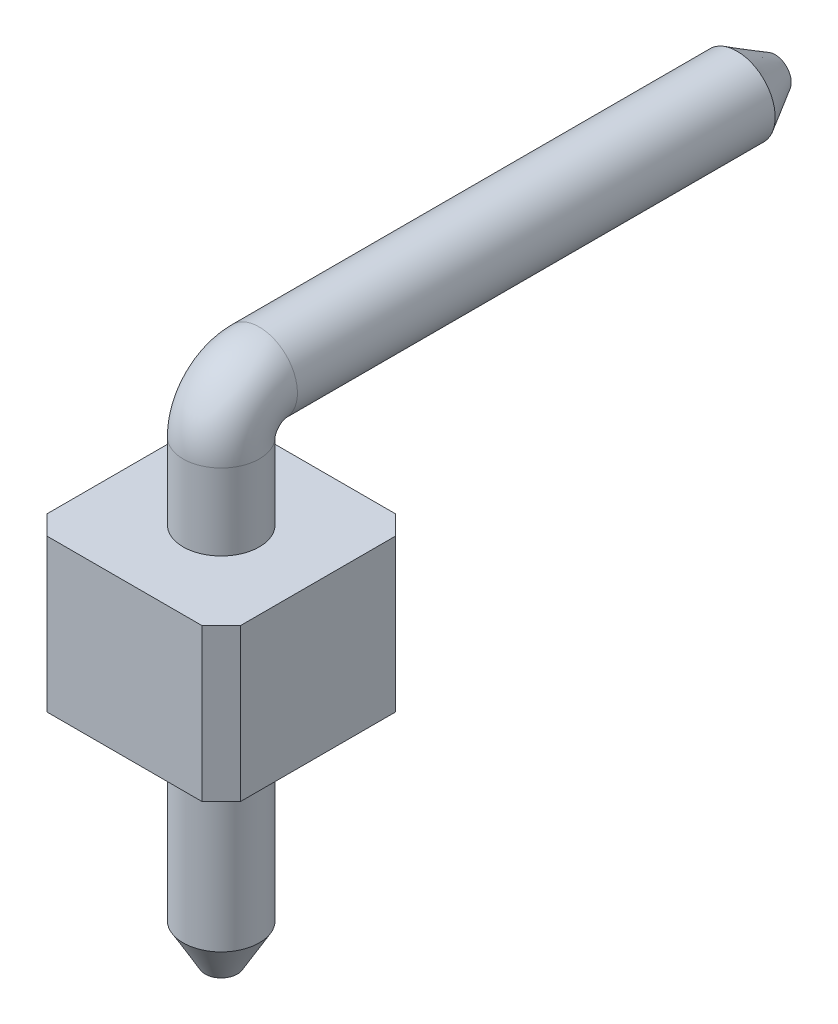
ISO-10303-21;
HEADER;
FILE_DESCRIPTION(('STEP AP214'),'2;1');
FILE_NAME('part.step','',(''),(''),'','','');
FILE_SCHEMA(('AUTOMOTIVE_DESIGN { 1 0 10303 214 1 1 1 1 }'));
ENDSEC;
DATA;
#1=APPLICATION_CONTEXT('core data for automotive mechanical design processes');
#2=APPLICATION_PROTOCOL_DEFINITION('international standard','automotive_design',2000,#1);
#3=PRODUCT_CONTEXT('',#1,'mechanical');
#4=PRODUCT('Part','Part','',(#3));
#5=PRODUCT_RELATED_PRODUCT_CATEGORY('part','',(#4));
#6=PRODUCT_DEFINITION_FORMATION('','',#4);
#7=PRODUCT_DEFINITION_CONTEXT('part definition',#1,'design');
#8=PRODUCT_DEFINITION('design','',#6,#7);
#9=PRODUCT_DEFINITION_SHAPE('','',#8);
#10=(LENGTH_UNIT() NAMED_UNIT(*) SI_UNIT(.MILLI.,.METRE.));
#11=(NAMED_UNIT(*) PLANE_ANGLE_UNIT() SI_UNIT($,.RADIAN.));
#12=(NAMED_UNIT(*) SI_UNIT($,.STERADIAN.) SOLID_ANGLE_UNIT());
#13=UNCERTAINTY_MEASURE_WITH_UNIT(LENGTH_MEASURE(1.E-05),#10,'distance_accuracy_value','');
#14=(GEOMETRIC_REPRESENTATION_CONTEXT(3) GLOBAL_UNCERTAINTY_ASSIGNED_CONTEXT((#13)) GLOBAL_UNIT_ASSIGNED_CONTEXT((#10,
#11,#12)) REPRESENTATION_CONTEXT('',''));
#15=CARTESIAN_POINT('',(0.,0.,0.));
#16=DIRECTION('',(0.,0.,1.));
#17=DIRECTION('',(1.,0.,0.));
#18=AXIS2_PLACEMENT_3D('',#15,#16,#17);
#19=CARTESIAN_POINT('',(1.27,2.,-1.27));
#20=DIRECTION('',(-1.,0.,0.));
#21=DIRECTION('',(0.,0.,1.));
#22=AXIS2_PLACEMENT_3D('',#19,#20,#21);
#23=PLANE('',#22);
#24=DIRECTION('',(0.,0.,-1.));
#25=VECTOR('',#24,1.);
#26=CARTESIAN_POINT('',(1.27,0.,-1.27));
#27=LINE('',#26,#25);
#28=CARTESIAN_POINT('',(1.27,0.,1.02));
#29=VERTEX_POINT('',#28);
#30=CARTESIAN_POINT('',(1.27,0.,-1.02));
#31=VERTEX_POINT('',#30);
#32=EDGE_CURVE('E113',#29,#31,#27,.T.);
#33=ORIENTED_EDGE('',*,*,#32,.T.);
#34=DIRECTION('',(0.,1.,0.));
#35=VECTOR('',#34,1.);
#36=CARTESIAN_POINT('',(1.27,2.,-1.02));
#37=LINE('',#36,#35);
#38=CARTESIAN_POINT('',(1.27,2.,-1.02));
#39=VERTEX_POINT('',#38);
#40=EDGE_CURVE('E122',#31,#39,#37,.T.);
#41=ORIENTED_EDGE('',*,*,#40,.T.);
#42=DIRECTION('',(0.,0.,-1.));
#43=VECTOR('',#42,1.);
#44=CARTESIAN_POINT('',(1.27,2.,-1.27));
#45=LINE('',#44,#43);
#46=CARTESIAN_POINT('',(1.27,2.,1.02));
#47=VERTEX_POINT('',#46);
#48=EDGE_CURVE('E123',#47,#39,#45,.T.);
#49=ORIENTED_EDGE('',*,*,#48,.F.);
#50=DIRECTION('',(0.,-1.,0.));
#51=VECTOR('',#50,1.);
#52=CARTESIAN_POINT('',(1.27,2.,1.02));
#53=LINE('',#52,#51);
#54=EDGE_CURVE('E172',#47,#29,#53,.T.);
#55=ORIENTED_EDGE('',*,*,#54,.T.);
#56=EDGE_LOOP('',(#33,#41,#49,#55));
#57=FACE_BOUND('',#56,.T.);
#58=ADVANCED_FACE('F36',(#57),#23,.F.);
#59=CARTESIAN_POINT('',(-1.27,2.,-1.27));
#60=DIRECTION('',(0.,0.,1.));
#61=DIRECTION('',(1.,0.,0.));
#62=AXIS2_PLACEMENT_3D('',#59,#60,#61);
#63=PLANE('',#62);
#64=DIRECTION('',(-1.,0.,0.));
#65=VECTOR('',#64,1.);
#66=CARTESIAN_POINT('',(-1.27,0.,-1.27));
#67=LINE('',#66,#65);
#68=CARTESIAN_POINT('',(1.02,0.,-1.27));
#69=VERTEX_POINT('',#68);
#70=CARTESIAN_POINT('',(-1.02,0.,-1.27));
#71=VERTEX_POINT('',#70);
#72=EDGE_CURVE('E137',#69,#71,#67,.T.);
#73=ORIENTED_EDGE('',*,*,#72,.T.);
#74=DIRECTION('',(0.,1.,0.));
#75=VECTOR('',#74,1.);
#76=CARTESIAN_POINT('',(-1.02,2.,-1.27));
#77=LINE('',#76,#75);
#78=CARTESIAN_POINT('',(-1.02,2.,-1.27));
#79=VERTEX_POINT('',#78);
#80=EDGE_CURVE('E159',#71,#79,#77,.T.);
#81=ORIENTED_EDGE('',*,*,#80,.T.);
#82=DIRECTION('',(-1.,0.,0.));
#83=VECTOR('',#82,1.);
#84=CARTESIAN_POINT('',(-1.27,2.,-1.27));
#85=LINE('',#84,#83);
#86=CARTESIAN_POINT('',(1.02,2.,-1.27));
#87=VERTEX_POINT('',#86);
#88=EDGE_CURVE('E126',#87,#79,#85,.T.);
#89=ORIENTED_EDGE('',*,*,#88,.F.);
#90=DIRECTION('',(0.,-1.,0.));
#91=VECTOR('',#90,1.);
#92=CARTESIAN_POINT('',(1.02,2.,-1.27));
#93=LINE('',#92,#91);
#94=EDGE_CURVE('E156',#87,#69,#93,.T.);
#95=ORIENTED_EDGE('',*,*,#94,.T.);
#96=EDGE_LOOP('',(#73,#81,#89,#95));
#97=FACE_BOUND('',#96,.T.);
#98=ADVANCED_FACE('F221',(#97),#63,.F.);
#99=CARTESIAN_POINT('',(-1.27,2.,-1.27));
#100=DIRECTION('',(1.,0.,0.));
#101=DIRECTION('',(0.,0.,-1.));
#102=AXIS2_PLACEMENT_3D('',#99,#100,#101);
#103=PLANE('',#102);
#104=DIRECTION('',(0.,0.,1.));
#105=VECTOR('',#104,1.);
#106=CARTESIAN_POINT('',(-1.27,2.,-1.27));
#107=LINE('',#106,#105);
#108=CARTESIAN_POINT('',(-1.27,2.,-1.02));
#109=VERTEX_POINT('',#108);
#110=CARTESIAN_POINT('',(-1.27,2.,1.02));
#111=VERTEX_POINT('',#110);
#112=EDGE_CURVE('E130',#109,#111,#107,.T.);
#113=ORIENTED_EDGE('',*,*,#112,.F.);
#114=DIRECTION('',(0.,-1.,0.));
#115=VECTOR('',#114,1.);
#116=CARTESIAN_POINT('',(-1.27,2.,-1.02));
#117=LINE('',#116,#115);
#118=CARTESIAN_POINT('',(-1.27,0.,-1.02));
#119=VERTEX_POINT('',#118);
#120=EDGE_CURVE('E145',#109,#119,#117,.T.);
#121=ORIENTED_EDGE('',*,*,#120,.T.);
#122=DIRECTION('',(0.,0.,1.));
#123=VECTOR('',#122,1.);
#124=CARTESIAN_POINT('',(-1.27,0.,-1.27));
#125=LINE('',#124,#123);
#126=CARTESIAN_POINT('',(-1.27,0.,1.02));
#127=VERTEX_POINT('',#126);
#128=EDGE_CURVE('E140',#119,#127,#125,.T.);
#129=ORIENTED_EDGE('',*,*,#128,.T.);
#130=DIRECTION('',(0.,1.,0.));
#131=VECTOR('',#130,1.);
#132=CARTESIAN_POINT('',(-1.27,2.,1.02));
#133=LINE('',#132,#131);
#134=EDGE_CURVE('E134',#127,#111,#133,.T.);
#135=ORIENTED_EDGE('',*,*,#134,.T.);
#136=EDGE_LOOP('',(#113,#121,#129,#135));
#137=FACE_BOUND('',#136,.T.);
#138=ADVANCED_FACE('F203',(#137),#103,.F.);
#139=CARTESIAN_POINT('',(-1.27,2.,1.27));
#140=DIRECTION('',(0.,0.,-1.));
#141=DIRECTION('',(-1.,0.,0.));
#142=AXIS2_PLACEMENT_3D('',#139,#140,#141);
#143=PLANE('',#142);
#144=DIRECTION('',(1.,0.,0.));
#145=VECTOR('',#144,1.);
#146=CARTESIAN_POINT('',(-1.27,2.,1.27));
#147=LINE('',#146,#145);
#148=CARTESIAN_POINT('',(-1.02,2.,1.27));
#149=VERTEX_POINT('',#148);
#150=CARTESIAN_POINT('',(1.02,2.,1.27));
#151=VERTEX_POINT('',#150);
#152=EDGE_CURVE('E132',#149,#151,#147,.T.);
#153=ORIENTED_EDGE('',*,*,#152,.F.);
#154=DIRECTION('',(0.,-1.,0.));
#155=VECTOR('',#154,1.);
#156=CARTESIAN_POINT('',(-1.02,2.,1.27));
#157=LINE('',#156,#155);
#158=CARTESIAN_POINT('',(-1.02,0.,1.27));
#159=VERTEX_POINT('',#158);
#160=EDGE_CURVE('E169',#149,#159,#157,.T.);
#161=ORIENTED_EDGE('',*,*,#160,.T.);
#162=DIRECTION('',(1.,0.,0.));
#163=VECTOR('',#162,1.);
#164=CARTESIAN_POINT('',(-1.27,0.,1.27));
#165=LINE('',#164,#163);
#166=CARTESIAN_POINT('',(1.02,0.,1.27));
#167=VERTEX_POINT('',#166);
#168=EDGE_CURVE('E127',#159,#167,#165,.T.);
#169=ORIENTED_EDGE('',*,*,#168,.T.);
#170=DIRECTION('',(0.,1.,0.));
#171=VECTOR('',#170,1.);
#172=CARTESIAN_POINT('',(1.02,2.,1.27));
#173=LINE('',#172,#171);
#174=EDGE_CURVE('E51',#167,#151,#173,.T.);
#175=ORIENTED_EDGE('',*,*,#174,.T.);
#176=EDGE_LOOP('',(#153,#161,#169,#175));
#177=FACE_BOUND('',#176,.T.);
#178=ADVANCED_FACE('F189',(#177),#143,.F.);
#179=CARTESIAN_POINT('',(0.,2.,0.));
#180=DIRECTION('',(0.,1.,0.));
#181=DIRECTION('',(0.,0.,1.));
#182=AXIS2_PLACEMENT_3D('',#179,#180,#181);
#183=PLANE('',#182);
#184=CARTESIAN_POINT('',(0.,2.,0.));
#185=DIRECTION('',(0.,1.,0.));
#186=DIRECTION('',(0.,0.,1.));
#187=AXIS2_PLACEMENT_3D('',#184,#185,#186);
#188=CIRCLE('',#187,0.5);
#189=CARTESIAN_POINT('',(0.,2.,0.5));
#190=VERTEX_POINT('',#189);
#191=EDGE_CURVE('E116',#190,#190,#188,.T.);
#192=ORIENTED_EDGE('',*,*,#191,.F.);
#193=EDGE_LOOP('',(#192));
#194=FACE_BOUND('',#193,.T.);
#195=ORIENTED_EDGE('',*,*,#88,.T.);
#196=DIRECTION('',(0.707106781186549,0.,-0.707106781186546));
#197=VECTOR('',#196,1.);
#198=CARTESIAN_POINT('',(-1.145,2.,-1.145));
#199=LINE('',#198,#197);
#200=EDGE_CURVE('E166',#79,#109,#199,.F.);
#201=ORIENTED_EDGE('',*,*,#200,.T.);
#202=ORIENTED_EDGE('',*,*,#112,.T.);
#203=DIRECTION('',(-0.707106781186546,0.,-0.707106781186549));
#204=VECTOR('',#203,1.);
#205=CARTESIAN_POINT('',(-1.145,2.,1.145));
#206=LINE('',#205,#204);
#207=EDGE_CURVE('E58',#111,#149,#206,.F.);
#208=ORIENTED_EDGE('',*,*,#207,.T.);
#209=ORIENTED_EDGE('',*,*,#152,.T.);
#210=DIRECTION('',(-0.707106781186548,0.,0.707106781186547));
#211=VECTOR('',#210,1.);
#212=CARTESIAN_POINT('',(1.145,2.,1.145));
#213=LINE('',#212,#211);
#214=EDGE_CURVE('E161',#151,#47,#213,.F.);
#215=ORIENTED_EDGE('',*,*,#214,.T.);
#216=ORIENTED_EDGE('',*,*,#48,.T.);
#217=DIRECTION('',(0.707106781186546,0.,0.707106781186549));
#218=VECTOR('',#217,1.);
#219=CARTESIAN_POINT('',(1.145,2.,-1.145));
#220=LINE('',#219,#218);
#221=EDGE_CURVE('E163',#39,#87,#220,.F.);
#222=ORIENTED_EDGE('',*,*,#221,.T.);
#223=EDGE_LOOP('',(#195,#201,#202,#208,#209,#215,#216,#222));
#224=FACE_BOUND('',#223,.T.);
#225=ADVANCED_FACE('F186',(#194,#224),#183,.T.);
#226=CARTESIAN_POINT('',(0.,0.,0.));
#227=DIRECTION('',(0.,1.,0.));
#228=DIRECTION('',(0.,0.,1.));
#229=AXIS2_PLACEMENT_3D('',#226,#227,#228);
#230=PLANE('',#229);
#231=CARTESIAN_POINT('',(0.,0.,0.));
#232=DIRECTION('',(0.,-1.,0.));
#233=DIRECTION('',(0.,0.,-1.));
#234=AXIS2_PLACEMENT_3D('',#231,#232,#233);
#235=CIRCLE('',#234,0.5);
#236=CARTESIAN_POINT('',(0.,0.,-0.5));
#237=VERTEX_POINT('',#236);
#238=EDGE_CURVE('E118',#237,#237,#235,.T.);
#239=ORIENTED_EDGE('',*,*,#238,.F.);
#240=EDGE_LOOP('',(#239));
#241=FACE_BOUND('',#240,.T.);
#242=ORIENTED_EDGE('',*,*,#128,.F.);
#243=DIRECTION('',(-0.707106781186549,0.,0.707106781186546));
#244=VECTOR('',#243,1.);
#245=CARTESIAN_POINT('',(-1.27,0.,-1.02));
#246=LINE('',#245,#244);
#247=EDGE_CURVE('E154',#119,#71,#246,.F.);
#248=ORIENTED_EDGE('',*,*,#247,.T.);
#249=ORIENTED_EDGE('',*,*,#72,.F.);
#250=DIRECTION('',(-0.707106781186546,0.,-0.707106781186549));
#251=VECTOR('',#250,1.);
#252=CARTESIAN_POINT('',(1.02,0.,-1.27));
#253=LINE('',#252,#251);
#254=EDGE_CURVE('E150',#69,#31,#253,.F.);
#255=ORIENTED_EDGE('',*,*,#254,.T.);
#256=ORIENTED_EDGE('',*,*,#32,.F.);
#257=DIRECTION('',(0.707106781186548,0.,-0.707106781186547));
#258=VECTOR('',#257,1.);
#259=CARTESIAN_POINT('',(1.27,0.,1.02));
#260=LINE('',#259,#258);
#261=EDGE_CURVE('E148',#29,#167,#260,.F.);
#262=ORIENTED_EDGE('',*,*,#261,.T.);
#263=ORIENTED_EDGE('',*,*,#168,.F.);
#264=DIRECTION('',(0.707106781186546,0.,0.707106781186549));
#265=VECTOR('',#264,1.);
#266=CARTESIAN_POINT('',(-1.02,0.,1.27));
#267=LINE('',#266,#265);
#268=EDGE_CURVE('E152',#159,#127,#267,.F.);
#269=ORIENTED_EDGE('',*,*,#268,.T.);
#270=EDGE_LOOP('',(#242,#248,#249,#255,#256,#262,#263,#269));
#271=FACE_BOUND('',#270,.T.);
#272=ADVANCED_FACE('F188',(#241,#271),#230,.F.);
#273=CARTESIAN_POINT('',(-1.27,2.,-1.02));
#274=DIRECTION('',(0.707106781186546,0.,0.707106781186549));
#275=DIRECTION('',(0.,-1.,0.));
#276=AXIS2_PLACEMENT_3D('',#273,#274,#275);
#277=PLANE('',#276);
#278=ORIENTED_EDGE('',*,*,#200,.F.);
#279=ORIENTED_EDGE('',*,*,#80,.F.);
#280=ORIENTED_EDGE('',*,*,#247,.F.);
#281=ORIENTED_EDGE('',*,*,#120,.F.);
#282=EDGE_LOOP('',(#278,#279,#280,#281));
#283=FACE_BOUND('',#282,.T.);
#284=ADVANCED_FACE('F200',(#283),#277,.F.);
#285=CARTESIAN_POINT('',(-1.02,2.,1.27));
#286=DIRECTION('',(0.707106781186549,0.,-0.707106781186546));
#287=DIRECTION('',(0.,-1.,0.));
#288=AXIS2_PLACEMENT_3D('',#285,#286,#287);
#289=PLANE('',#288);
#290=ORIENTED_EDGE('',*,*,#207,.F.);
#291=ORIENTED_EDGE('',*,*,#134,.F.);
#292=ORIENTED_EDGE('',*,*,#268,.F.);
#293=ORIENTED_EDGE('',*,*,#160,.F.);
#294=EDGE_LOOP('',(#290,#291,#292,#293));
#295=FACE_BOUND('',#294,.T.);
#296=ADVANCED_FACE('F210',(#295),#289,.F.);
#297=CARTESIAN_POINT('',(1.02,2.,-1.27));
#298=DIRECTION('',(-0.707106781186549,0.,0.707106781186546));
#299=DIRECTION('',(0.,-1.,0.));
#300=AXIS2_PLACEMENT_3D('',#297,#298,#299);
#301=PLANE('',#300);
#302=ORIENTED_EDGE('',*,*,#221,.F.);
#303=ORIENTED_EDGE('',*,*,#40,.F.);
#304=ORIENTED_EDGE('',*,*,#254,.F.);
#305=ORIENTED_EDGE('',*,*,#94,.F.);
#306=EDGE_LOOP('',(#302,#303,#304,#305));
#307=FACE_BOUND('',#306,.T.);
#308=ADVANCED_FACE('F220',(#307),#301,.F.);
#309=CARTESIAN_POINT('',(1.27,2.,1.02));
#310=DIRECTION('',(-0.707106781186547,0.,-0.707106781186548));
#311=DIRECTION('',(0.,-1.,0.));
#312=AXIS2_PLACEMENT_3D('',#309,#310,#311);
#313=PLANE('',#312);
#314=ORIENTED_EDGE('',*,*,#214,.F.);
#315=ORIENTED_EDGE('',*,*,#174,.F.);
#316=ORIENTED_EDGE('',*,*,#261,.F.);
#317=ORIENTED_EDGE('',*,*,#54,.F.);
#318=EDGE_LOOP('',(#314,#315,#316,#317));
#319=FACE_BOUND('',#318,.T.);
#320=ADVANCED_FACE('F215',(#319),#313,.F.);
#321=CARTESIAN_POINT('',(0.,-3.,0.));
#322=DIRECTION('',(0.,1.,0.));
#323=DIRECTION('',(0.,0.,1.));
#324=AXIS2_PLACEMENT_3D('',#321,#322,#323);
#325=CYLINDRICAL_SURFACE('',#324,0.5);
#326=CARTESIAN_POINT('',(0.,-2.5,0.));
#327=DIRECTION('',(0.,-1.,0.));
#328=DIRECTION('',(0.,0.,-1.));
#329=AXIS2_PLACEMENT_3D('',#326,#327,#328);
#330=CIRCLE('',#329,0.5);
#331=CARTESIAN_POINT('',(0.,-2.5,-0.5));
#332=VERTEX_POINT('',#331);
#333=EDGE_CURVE('E178',#332,#332,#330,.F.);
#334=ORIENTED_EDGE('',*,*,#333,.T.);
#335=EDGE_LOOP('',(#334));
#336=FACE_BOUND('',#335,.T.);
#337=ORIENTED_EDGE('',*,*,#238,.T.);
#338=EDGE_LOOP('',(#337));
#339=FACE_BOUND('',#338,.T.);
#340=ADVANCED_FACE('F239',(#336,#339),#325,.T.);
#341=CARTESIAN_POINT('',(0.,-3.,0.));
#342=DIRECTION('',(0.,-1.,0.));
#343=DIRECTION('',(0.,0.,-1.));
#344=AXIS2_PLACEMENT_3D('',#341,#342,#343);
#345=PLANE('',#344);
#346=CARTESIAN_POINT('',(0.,-3.,0.));
#347=DIRECTION('',(0.,-1.,0.));
#348=DIRECTION('',(0.,0.,-1.));
#349=AXIS2_PLACEMENT_3D('',#346,#347,#348);
#350=CIRCLE('',#349,0.211324865405186);
#351=CARTESIAN_POINT('',(0.,-3.,-0.211324865405186));
#352=VERTEX_POINT('',#351);
#353=EDGE_CURVE('E121',#352,#352,#350,.T.);
#354=ORIENTED_EDGE('',*,*,#353,.T.);
#355=EDGE_LOOP('',(#354));
#356=FACE_BOUND('',#355,.T.);
#357=ADVANCED_FACE('F243',(#356),#345,.T.);
#358=CARTESIAN_POINT('',(0.,-3.,0.));
#359=DIRECTION('',(0.,1.,0.));
#360=DIRECTION('',(0.,0.,1.));
#361=AXIS2_PLACEMENT_3D('',#358,#359,#360);
#362=CONICAL_SURFACE('',#361,0.211324865405186,0.523598775598297);
#363=ORIENTED_EDGE('',*,*,#333,.F.);
#364=EDGE_LOOP('',(#363));
#365=FACE_BOUND('',#364,.T.);
#366=ORIENTED_EDGE('',*,*,#353,.F.);
#367=EDGE_LOOP('',(#366));
#368=FACE_BOUND('',#367,.T.);
#369=ADVANCED_FACE('F240',(#365,#368),#362,.T.);
#370=CARTESIAN_POINT('',(0.,3.5,-7.27));
#371=DIRECTION('',(0.,0.,-1.));
#372=DIRECTION('',(0.,1.,0.));
#373=AXIS2_PLACEMENT_3D('',#370,#371,#372);
#374=PLANE('',#373);
#375=CARTESIAN_POINT('',(0.,3.5,-7.27));
#376=DIRECTION('',(0.,0.,-1.));
#377=DIRECTION('',(0.,1.,0.));
#378=AXIS2_PLACEMENT_3D('',#375,#376,#377);
#379=CIRCLE('',#378,0.211324865405187);
#380=CARTESIAN_POINT('',(0.,3.71132486540519,-7.27));
#381=VERTEX_POINT('',#380);
#382=EDGE_CURVE('E44',#381,#381,#379,.T.);
#383=ORIENTED_EDGE('',*,*,#382,.T.);
#384=EDGE_LOOP('',(#383));
#385=FACE_BOUND('',#384,.T.);
#386=ADVANCED_FACE('F242',(#385),#374,.T.);
#387=CARTESIAN_POINT('',(0.,2.,0.));
#388=DIRECTION('',(0.,1.,0.));
#389=DIRECTION('',(0.,0.,1.));
#390=AXIS2_PLACEMENT_3D('',#387,#388,#389);
#391=CYLINDRICAL_SURFACE('',#390,0.5);
#392=CARTESIAN_POINT('',(0.,3.,0.));
#393=DIRECTION('',(0.,1.,0.));
#394=DIRECTION('',(0.,0.,1.));
#395=AXIS2_PLACEMENT_3D('',#392,#393,#394);
#396=CIRCLE('',#395,0.5);
#397=CARTESIAN_POINT('',(0.,3.,-0.5));
#398=VERTEX_POINT('',#397);
#399=EDGE_CURVE('E105',#398,#398,#396,.T.);
#400=ORIENTED_EDGE('',*,*,#399,.F.);
#401=EDGE_LOOP('',(#400));
#402=FACE_BOUND('',#401,.T.);
#403=ORIENTED_EDGE('',*,*,#191,.T.);
#404=EDGE_LOOP('',(#403));
#405=FACE_BOUND('',#404,.T.);
#406=ADVANCED_FACE('F106',(#402,#405),#391,.T.);
#407=CARTESIAN_POINT('',(0.,3.,0.));
#408=DIRECTION('',(0.,-1.,0.));
#409=DIRECTION('',(0.,0.,1.));
#410=AXIS2_PLACEMENT_3D('',#407,#408,#409);
#411=CIRCLE('',#410,0.5);
#412=TRIMMED_CURVE('',#411,(PARAMETER_VALUE(-3.14159254717422)),
(PARAMETER_VALUE(3.14159254717422)),.T.,.PARAMETER.);
#413=CARTESIAN_POINT('',(0.,3.,-0.5));
#414=DIRECTION('',(-1.,0.,0.));
#415=AXIS1_PLACEMENT('',#413,#414);
#416=SURFACE_OF_REVOLUTION('',#412,#415);
#417=CARTESIAN_POINT('',(0.,3.5,-0.5));
#418=DIRECTION('',(0.,0.,-1.));
#419=DIRECTION('',(0.,1.,0.));
#420=AXIS2_PLACEMENT_3D('',#417,#418,#419);
#421=CIRCLE('',#420,0.5);
#422=EDGE_CURVE('E111',#398,#398,#421,.T.);
#423=ORIENTED_EDGE('',*,*,#422,.F.);
#424=ORIENTED_EDGE('',*,*,#399,.T.);
#425=EDGE_LOOP('',(#423,#424));
#426=FACE_BOUND('',#425,.T.);
#427=ADVANCED_FACE('F256',(#426),#416,.T.);
#428=CARTESIAN_POINT('',(0.,3.5,-0.5));
#429=DIRECTION('',(0.,0.,-1.));
#430=DIRECTION('',(0.,1.,0.));
#431=AXIS2_PLACEMENT_3D('',#428,#429,#430);
#432=CYLINDRICAL_SURFACE('',#431,0.5);
#433=CARTESIAN_POINT('',(0.,3.5,-6.77));
#434=DIRECTION('',(0.,0.,-1.));
#435=DIRECTION('',(-1.,0.,0.));
#436=AXIS2_PLACEMENT_3D('',#433,#434,#435);
#437=CIRCLE('',#436,0.5);
#438=CARTESIAN_POINT('',(-0.5,3.5,-6.77));
#439=VERTEX_POINT('',#438);
#440=EDGE_CURVE('E11',#439,#439,#437,.F.);
#441=ORIENTED_EDGE('',*,*,#440,.T.);
#442=EDGE_LOOP('',(#441));
#443=FACE_BOUND('',#442,.T.);
#444=ORIENTED_EDGE('',*,*,#422,.T.);
#445=EDGE_LOOP('',(#444));
#446=FACE_BOUND('',#445,.T.);
#447=ADVANCED_FACE('F245',(#443,#446),#432,.T.);
#448=CARTESIAN_POINT('',(0.,3.5,-7.27));
#449=DIRECTION('',(0.,0.,1.));
#450=DIRECTION('',(1.,0.,0.));
#451=AXIS2_PLACEMENT_3D('',#448,#449,#450);
#452=CONICAL_SURFACE('',#451,0.211324865405187,0.523598775598297);
#453=ORIENTED_EDGE('',*,*,#440,.F.);
#454=EDGE_LOOP('',(#453));
#455=FACE_BOUND('',#454,.T.);
#456=ORIENTED_EDGE('',*,*,#382,.F.);
#457=EDGE_LOOP('',(#456));
#458=FACE_BOUND('',#457,.T.);
#459=ADVANCED_FACE('F38',(#455,#458),#452,.T.);
#460=CLOSED_SHELL('',(#58,#98,#138,#178,#225,#272,#284,#296,#308,#320,#340,#357,#369,#386,#406,
#427,#447,#459));
#461=MANIFOLD_SOLID_BREP('B2',#460);
#462=ADVANCED_BREP_SHAPE_REPRESENTATION('',(#18,#461),#14);
#463=SHAPE_DEFINITION_REPRESENTATION(#9,#462);
ENDSEC;
END-ISO-10303-21;
